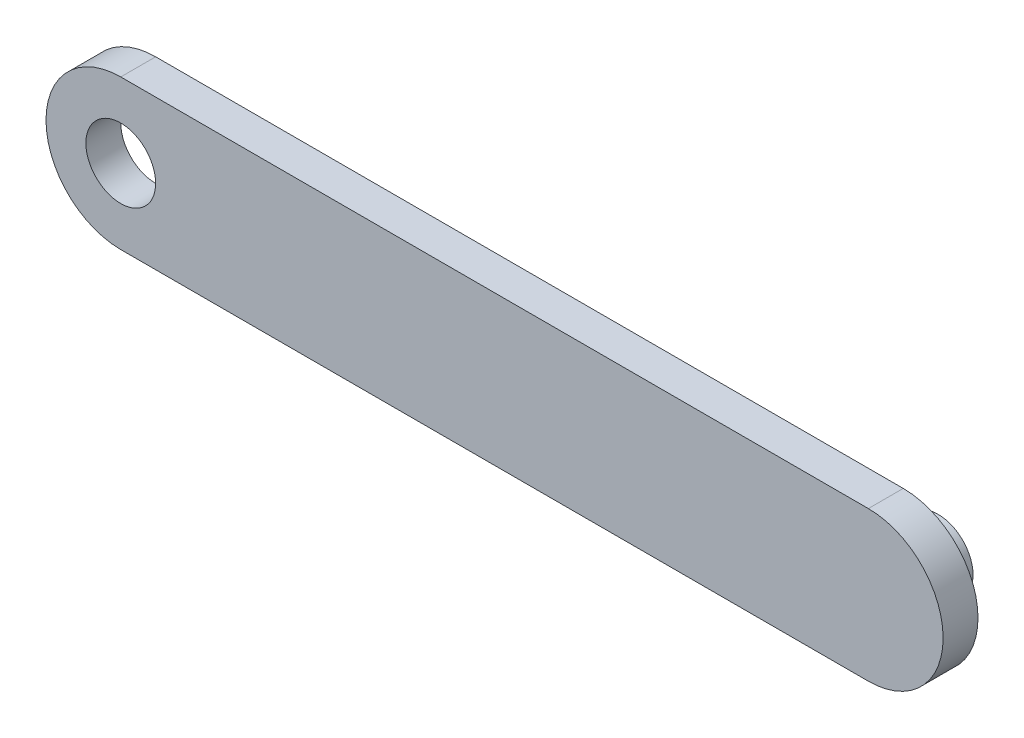
ISO-10303-21;
HEADER;
FILE_DESCRIPTION(('STEP AP214'),'2;1');
FILE_NAME('part.step','',(''),(''),'','','');
FILE_SCHEMA(('AUTOMOTIVE_DESIGN { 1 0 10303 214 1 1 1 1 }'));
ENDSEC;
DATA;
#1=APPLICATION_CONTEXT('core data for automotive mechanical design processes');
#2=APPLICATION_PROTOCOL_DEFINITION('international standard','automotive_design',2000,#1);
#3=PRODUCT_CONTEXT('',#1,'mechanical');
#4=PRODUCT('Part','Part','',(#3));
#5=PRODUCT_RELATED_PRODUCT_CATEGORY('part','',(#4));
#6=PRODUCT_DEFINITION_FORMATION('','',#4);
#7=PRODUCT_DEFINITION_CONTEXT('part definition',#1,'design');
#8=PRODUCT_DEFINITION('design','',#6,#7);
#9=PRODUCT_DEFINITION_SHAPE('','',#8);
#10=(LENGTH_UNIT() NAMED_UNIT(*) SI_UNIT(.MILLI.,.METRE.));
#11=(NAMED_UNIT(*) PLANE_ANGLE_UNIT() SI_UNIT($,.RADIAN.));
#12=(NAMED_UNIT(*) SI_UNIT($,.STERADIAN.) SOLID_ANGLE_UNIT());
#13=UNCERTAINTY_MEASURE_WITH_UNIT(LENGTH_MEASURE(1.E-05),#10,'distance_accuracy_value','');
#14=(GEOMETRIC_REPRESENTATION_CONTEXT(3) GLOBAL_UNCERTAINTY_ASSIGNED_CONTEXT((#13)) GLOBAL_UNIT_ASSIGNED_CONTEXT((#10,
#11,#12)) REPRESENTATION_CONTEXT('',''));
#15=CARTESIAN_POINT('',(0.,0.,0.));
#16=DIRECTION('',(0.,0.,1.));
#17=DIRECTION('',(1.,0.,0.));
#18=AXIS2_PLACEMENT_3D('',#15,#16,#17);
#19=CARTESIAN_POINT('',(-75.,0.,7.));
#20=DIRECTION('',(0.,0.,-1.));
#21=DIRECTION('',(-1.,0.,0.));
#22=AXIS2_PLACEMENT_3D('',#19,#20,#21);
#23=CYLINDRICAL_SURFACE('',#22,15.);
#24=CARTESIAN_POINT('',(-75.,0.,0.));
#25=DIRECTION('',(0.,0.,1.));
#26=DIRECTION('',(1.,0.,0.));
#27=AXIS2_PLACEMENT_3D('',#24,#25,#26);
#28=CIRCLE('',#27,15.);
#29=CARTESIAN_POINT('',(-75.,15.,0.));
#30=VERTEX_POINT('',#29);
#31=CARTESIAN_POINT('',(-75.,-15.,0.));
#32=VERTEX_POINT('',#31);
#33=EDGE_CURVE('E96',#30,#32,#28,.T.);
#34=ORIENTED_EDGE('',*,*,#33,.T.);
#35=DIRECTION('',(0.,0.,-1.));
#36=VECTOR('',#35,1.);
#37=CARTESIAN_POINT('',(-75.,-15.,7.));
#38=LINE('',#37,#36);
#39=CARTESIAN_POINT('',(-75.,-15.,7.));
#40=VERTEX_POINT('',#39);
#41=EDGE_CURVE('E11',#40,#32,#38,.T.);
#42=ORIENTED_EDGE('',*,*,#41,.F.);
#43=CARTESIAN_POINT('',(-75.,0.,7.));
#44=DIRECTION('',(0.,0.,1.));
#45=DIRECTION('',(1.,0.,0.));
#46=AXIS2_PLACEMENT_3D('',#43,#44,#45);
#47=CIRCLE('',#46,15.);
#48=CARTESIAN_POINT('',(-75.,15.,7.));
#49=VERTEX_POINT('',#48);
#50=EDGE_CURVE('E84',#49,#40,#47,.T.);
#51=ORIENTED_EDGE('',*,*,#50,.F.);
#52=DIRECTION('',(0.,0.,-1.));
#53=VECTOR('',#52,1.);
#54=CARTESIAN_POINT('',(-75.,15.,7.));
#55=LINE('',#54,#53);
#56=EDGE_CURVE('E92',#49,#30,#55,.T.);
#57=ORIENTED_EDGE('',*,*,#56,.T.);
#58=EDGE_LOOP('',(#34,#42,#51,#57));
#59=FACE_BOUND('',#58,.T.);
#60=ADVANCED_FACE('F33',(#59),#23,.T.);
#61=CARTESIAN_POINT('',(-75.,-15.,7.));
#62=DIRECTION('',(0.,1.,0.));
#63=DIRECTION('',(0.,0.,1.));
#64=AXIS2_PLACEMENT_3D('',#61,#62,#63);
#65=PLANE('',#64);
#66=DIRECTION('',(1.,0.,0.));
#67=VECTOR('',#66,1.);
#68=CARTESIAN_POINT('',(-75.,-15.,0.));
#69=LINE('',#68,#67);
#70=CARTESIAN_POINT('',(75.,-15.,0.));
#71=VERTEX_POINT('',#70);
#72=EDGE_CURVE('E88',#32,#71,#69,.T.);
#73=ORIENTED_EDGE('',*,*,#72,.T.);
#74=DIRECTION('',(0.,0.,-1.));
#75=VECTOR('',#74,1.);
#76=CARTESIAN_POINT('',(75.,-15.,7.));
#77=LINE('',#76,#75);
#78=CARTESIAN_POINT('',(75.,-15.,7.));
#79=VERTEX_POINT('',#78);
#80=EDGE_CURVE('E41',#79,#71,#77,.T.);
#81=ORIENTED_EDGE('',*,*,#80,.F.);
#82=DIRECTION('',(1.,0.,0.));
#83=VECTOR('',#82,1.);
#84=CARTESIAN_POINT('',(-75.,-15.,7.));
#85=LINE('',#84,#83);
#86=EDGE_CURVE('E79',#40,#79,#85,.T.);
#87=ORIENTED_EDGE('',*,*,#86,.F.);
#88=ORIENTED_EDGE('',*,*,#41,.T.);
#89=EDGE_LOOP('',(#73,#81,#87,#88));
#90=FACE_BOUND('',#89,.T.);
#91=ADVANCED_FACE('F87',(#90),#65,.F.);
#92=CARTESIAN_POINT('',(75.,0.,7.));
#93=DIRECTION('',(0.,0.,-1.));
#94=DIRECTION('',(-1.,0.,0.));
#95=AXIS2_PLACEMENT_3D('',#92,#93,#94);
#96=CYLINDRICAL_SURFACE('',#95,15.);
#97=CARTESIAN_POINT('',(75.,0.,0.));
#98=DIRECTION('',(0.,0.,1.));
#99=DIRECTION('',(1.,0.,0.));
#100=AXIS2_PLACEMENT_3D('',#97,#98,#99);
#101=CIRCLE('',#100,15.);
#102=CARTESIAN_POINT('',(75.,15.,0.));
#103=VERTEX_POINT('',#102);
#104=EDGE_CURVE('E66',#71,#103,#101,.T.);
#105=ORIENTED_EDGE('',*,*,#104,.T.);
#106=DIRECTION('',(0.,0.,-1.));
#107=VECTOR('',#106,1.);
#108=CARTESIAN_POINT('',(75.,15.,7.));
#109=LINE('',#108,#107);
#110=CARTESIAN_POINT('',(75.,15.,7.));
#111=VERTEX_POINT('',#110);
#112=EDGE_CURVE('E89',#111,#103,#109,.T.);
#113=ORIENTED_EDGE('',*,*,#112,.F.);
#114=CARTESIAN_POINT('',(75.,0.,7.));
#115=DIRECTION('',(0.,0.,1.));
#116=DIRECTION('',(1.,0.,0.));
#117=AXIS2_PLACEMENT_3D('',#114,#115,#116);
#118=CIRCLE('',#117,15.);
#119=EDGE_CURVE('E82',#79,#111,#118,.T.);
#120=ORIENTED_EDGE('',*,*,#119,.F.);
#121=ORIENTED_EDGE('',*,*,#80,.T.);
#122=EDGE_LOOP('',(#105,#113,#120,#121));
#123=FACE_BOUND('',#122,.T.);
#124=ADVANCED_FACE('F90',(#123),#96,.T.);
#125=CARTESIAN_POINT('',(-75.,15.,7.));
#126=DIRECTION('',(0.,-1.,0.));
#127=DIRECTION('',(0.,0.,-1.));
#128=AXIS2_PLACEMENT_3D('',#125,#126,#127);
#129=PLANE('',#128);
#130=DIRECTION('',(-1.,0.,0.));
#131=VECTOR('',#130,1.);
#132=CARTESIAN_POINT('',(-75.,15.,0.));
#133=LINE('',#132,#131);
#134=EDGE_CURVE('E72',#103,#30,#133,.T.);
#135=ORIENTED_EDGE('',*,*,#134,.T.);
#136=ORIENTED_EDGE('',*,*,#56,.F.);
#137=DIRECTION('',(-1.,0.,0.));
#138=VECTOR('',#137,1.);
#139=CARTESIAN_POINT('',(-75.,15.,7.));
#140=LINE('',#139,#138);
#141=EDGE_CURVE('E49',#111,#49,#140,.T.);
#142=ORIENTED_EDGE('',*,*,#141,.F.);
#143=ORIENTED_EDGE('',*,*,#112,.T.);
#144=EDGE_LOOP('',(#135,#136,#142,#143));
#145=FACE_BOUND('',#144,.T.);
#146=ADVANCED_FACE('F104',(#145),#129,.F.);
#147=CARTESIAN_POINT('',(-75.,0.,7.));
#148=DIRECTION('',(0.,0.,1.));
#149=DIRECTION('',(1.,0.,0.));
#150=AXIS2_PLACEMENT_3D('',#147,#148,#149);
#151=PLANE('',#150);
#152=CARTESIAN_POINT('',(-75.,0.,7.));
#153=DIRECTION('',(0.,0.,-1.));
#154=DIRECTION('',(-1.,0.,0.));
#155=AXIS2_PLACEMENT_3D('',#152,#153,#154);
#156=CIRCLE('',#155,7.);
#157=CARTESIAN_POINT('',(-82.,0.,7.));
#158=VERTEX_POINT('',#157);
#159=EDGE_CURVE('E113',#158,#158,#156,.T.);
#160=ORIENTED_EDGE('',*,*,#159,.T.);
#161=EDGE_LOOP('',(#160));
#162=FACE_BOUND('',#161,.T.);
#163=ORIENTED_EDGE('',*,*,#50,.T.);
#164=ORIENTED_EDGE('',*,*,#86,.T.);
#165=ORIENTED_EDGE('',*,*,#119,.T.);
#166=ORIENTED_EDGE('',*,*,#141,.T.);
#167=EDGE_LOOP('',(#163,#164,#165,#166));
#168=FACE_BOUND('',#167,.T.);
#169=ADVANCED_FACE('F80',(#162,#168),#151,.T.);
#170=CARTESIAN_POINT('',(-75.,0.,0.));
#171=DIRECTION('',(0.,0.,1.));
#172=DIRECTION('',(1.,0.,0.));
#173=AXIS2_PLACEMENT_3D('',#170,#171,#172);
#174=PLANE('',#173);
#175=CARTESIAN_POINT('',(-75.,0.,0.));
#176=DIRECTION('',(0.,0.,-1.));
#177=DIRECTION('',(-1.,0.,0.));
#178=AXIS2_PLACEMENT_3D('',#175,#176,#177);
#179=CIRCLE('',#178,7.);
#180=CARTESIAN_POINT('',(-82.,0.,0.));
#181=VERTEX_POINT('',#180);
#182=EDGE_CURVE('E116',#181,#181,#179,.T.);
#183=ORIENTED_EDGE('',*,*,#182,.F.);
#184=EDGE_LOOP('',(#183));
#185=FACE_BOUND('',#184,.T.);
#186=CARTESIAN_POINT('',(75.,0.,0.));
#187=DIRECTION('',(0.,0.,1.));
#188=DIRECTION('',(1.,0.,0.));
#189=AXIS2_PLACEMENT_3D('',#186,#187,#188);
#190=CIRCLE('',#189,7.);
#191=CARTESIAN_POINT('',(82.,0.,0.));
#192=VERTEX_POINT('',#191);
#193=EDGE_CURVE('E110',#192,#192,#190,.T.);
#194=ORIENTED_EDGE('',*,*,#193,.T.);
#195=EDGE_LOOP('',(#194));
#196=FACE_BOUND('',#195,.T.);
#197=ORIENTED_EDGE('',*,*,#33,.F.);
#198=ORIENTED_EDGE('',*,*,#134,.F.);
#199=ORIENTED_EDGE('',*,*,#104,.F.);
#200=ORIENTED_EDGE('',*,*,#72,.F.);
#201=EDGE_LOOP('',(#197,#198,#199,#200));
#202=FACE_BOUND('',#201,.T.);
#203=ADVANCED_FACE('F107',(#185,#196,#202),#174,.F.);
#204=CARTESIAN_POINT('',(75.,0.,-7.));
#205=DIRECTION('',(0.,0.,1.));
#206=DIRECTION('',(1.,0.,0.));
#207=AXIS2_PLACEMENT_3D('',#204,#205,#206);
#208=CYLINDRICAL_SURFACE('',#207,7.);
#209=CARTESIAN_POINT('',(75.,0.,-7.));
#210=DIRECTION('',(0.,0.,1.));
#211=DIRECTION('',(1.,0.,0.));
#212=AXIS2_PLACEMENT_3D('',#209,#210,#211);
#213=CIRCLE('',#212,7.);
#214=CARTESIAN_POINT('',(82.,0.,-7.));
#215=VERTEX_POINT('',#214);
#216=EDGE_CURVE('E99',#215,#215,#213,.T.);
#217=ORIENTED_EDGE('',*,*,#216,.T.);
#218=EDGE_LOOP('',(#217));
#219=FACE_BOUND('',#218,.T.);
#220=ORIENTED_EDGE('',*,*,#193,.F.);
#221=EDGE_LOOP('',(#220));
#222=FACE_BOUND('',#221,.T.);
#223=ADVANCED_FACE('F132',(#219,#222),#208,.T.);
#224=CARTESIAN_POINT('',(75.,0.,-7.));
#225=DIRECTION('',(0.,0.,1.));
#226=DIRECTION('',(1.,0.,0.));
#227=AXIS2_PLACEMENT_3D('',#224,#225,#226);
#228=PLANE('',#227);
#229=ORIENTED_EDGE('',*,*,#216,.F.);
#230=EDGE_LOOP('',(#229));
#231=FACE_BOUND('',#230,.T.);
#232=ADVANCED_FACE('F126',(#231),#228,.F.);
#233=CARTESIAN_POINT('',(-75.,0.,7.));
#234=DIRECTION('',(0.,0.,-1.));
#235=DIRECTION('',(-1.,0.,0.));
#236=AXIS2_PLACEMENT_3D('',#233,#234,#235);
#237=CYLINDRICAL_SURFACE('',#236,7.);
#238=ORIENTED_EDGE('',*,*,#159,.F.);
#239=EDGE_LOOP('',(#238));
#240=FACE_BOUND('',#239,.T.);
#241=ORIENTED_EDGE('',*,*,#182,.T.);
#242=EDGE_LOOP('',(#241));
#243=FACE_BOUND('',#242,.T.);
#244=ADVANCED_FACE('F123',(#240,#243),#237,.F.);
#245=CLOSED_SHELL('',(#60,#91,#124,#146,#169,#203,#223,#232,#244));
#246=MANIFOLD_SOLID_BREP('B2',#245);
#247=ADVANCED_BREP_SHAPE_REPRESENTATION('',(#18,#246),#14);
#248=SHAPE_DEFINITION_REPRESENTATION(#9,#247);
ENDSEC;
END-ISO-10303-21;
